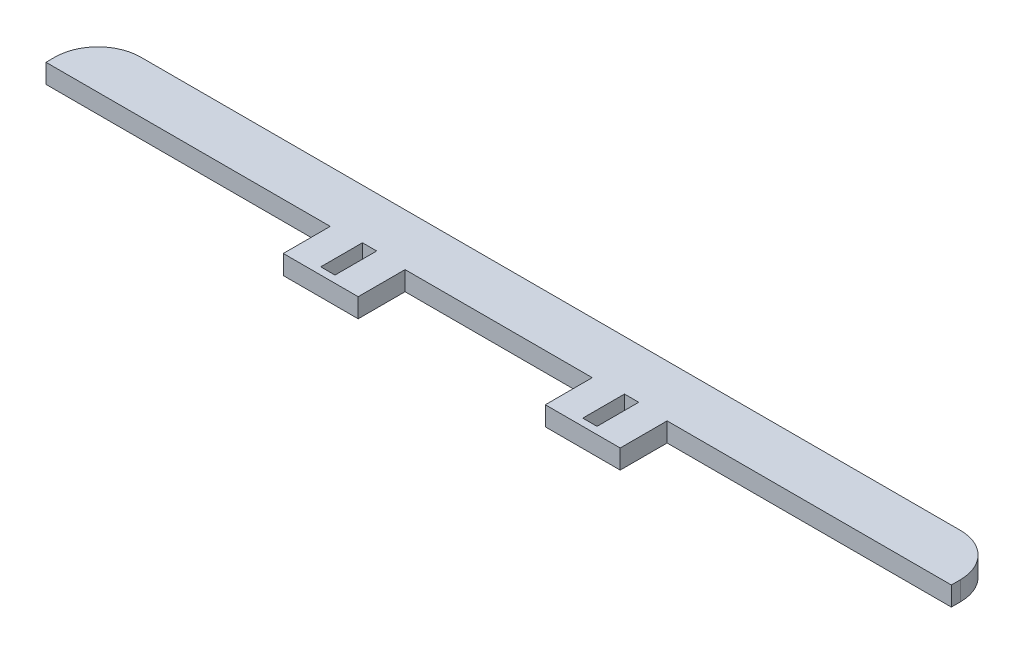
ISO-10303-21;
HEADER;
FILE_DESCRIPTION(('STEP AP214'),'2;1');
FILE_NAME('part.step','',(''),(''),'','','');
FILE_SCHEMA(('AUTOMOTIVE_DESIGN { 1 0 10303 214 1 1 1 1 }'));
ENDSEC;
DATA;
#1=APPLICATION_CONTEXT('core data for automotive mechanical design processes');
#2=APPLICATION_PROTOCOL_DEFINITION('international standard','automotive_design',2000,#1);
#3=PRODUCT_CONTEXT('',#1,'mechanical');
#4=PRODUCT('Part','Part','',(#3));
#5=PRODUCT_RELATED_PRODUCT_CATEGORY('part','',(#4));
#6=PRODUCT_DEFINITION_FORMATION('','',#4);
#7=PRODUCT_DEFINITION_CONTEXT('part definition',#1,'design');
#8=PRODUCT_DEFINITION('design','',#6,#7);
#9=PRODUCT_DEFINITION_SHAPE('','',#8);
#10=(LENGTH_UNIT() NAMED_UNIT(*) SI_UNIT(.MILLI.,.METRE.));
#11=(NAMED_UNIT(*) PLANE_ANGLE_UNIT() SI_UNIT($,.RADIAN.));
#12=(NAMED_UNIT(*) SI_UNIT($,.STERADIAN.) SOLID_ANGLE_UNIT());
#13=UNCERTAINTY_MEASURE_WITH_UNIT(LENGTH_MEASURE(1.E-05),#10,'distance_accuracy_value','');
#14=(GEOMETRIC_REPRESENTATION_CONTEXT(3) GLOBAL_UNCERTAINTY_ASSIGNED_CONTEXT((#13)) GLOBAL_UNIT_ASSIGNED_CONTEXT((#10,
#11,#12)) REPRESENTATION_CONTEXT('',''));
#15=CARTESIAN_POINT('',(0.,0.,0.));
#16=DIRECTION('',(0.,0.,1.));
#17=DIRECTION('',(1.,0.,0.));
#18=AXIS2_PLACEMENT_3D('',#15,#16,#17);
#19=CARTESIAN_POINT('',(11.4999999999774,2.27942664743352E-11,0.));
#20=DIRECTION('',(7.24136028917854E-13,-1.,0.));
#21=DIRECTION('',(0.,0.,1.));
#22=AXIS2_PLACEMENT_3D('',#19,#20,#21);
#23=PLANE('',#22);
#24=DIRECTION('',(-1.,0.,0.));
#25=VECTOR('',#24,1.);
#26=CARTESIAN_POINT('',(44.4999999999735,4.66918170793917E-11,1.));
#27=LINE('',#26,#25);
#28=CARTESIAN_POINT('',(44.4999999999735,4.66918170793917E-11,1.));
#29=VERTEX_POINT('',#28);
#30=CARTESIAN_POINT('',(40.4999999999774,4.66918170793917E-11,1.));
#31=VERTEX_POINT('',#30);
#32=EDGE_CURVE('E205',#29,#31,#27,.T.);
#33=ORIENTED_EDGE('',*,*,#32,.F.);
#34=DIRECTION('',(0.,0.,1.));
#35=VECTOR('',#34,1.);
#36=CARTESIAN_POINT('',(44.4999999999774,4.66918170793917E-11,-10.7));
#37=LINE('',#36,#35);
#38=CARTESIAN_POINT('',(44.4999999999774,4.66918170793917E-11,-10.7));
#39=VERTEX_POINT('',#38);
#40=EDGE_CURVE('E187',#39,#29,#37,.T.);
#41=ORIENTED_EDGE('',*,*,#40,.F.);
#42=DIRECTION('',(1.,7.24136028917854E-13,0.));
#43=VECTOR('',#42,1.);
#44=CARTESIAN_POINT('',(40.4999999999774,4.37913594275585E-11,-10.7));
#45=LINE('',#44,#43);
#46=CARTESIAN_POINT('',(40.4999999999774,4.37913594275585E-11,-10.7));
#47=VERTEX_POINT('',#46);
#48=EDGE_CURVE('E199',#47,#39,#45,.T.);
#49=ORIENTED_EDGE('',*,*,#48,.F.);
#50=DIRECTION('',(0.,0.,-1.));
#51=VECTOR('',#50,1.);
#52=CARTESIAN_POINT('',(40.4999999999774,4.37913594275585E-11,-10.7));
#53=LINE('',#52,#51);
#54=EDGE_CURVE('E211',#31,#47,#53,.T.);
#55=ORIENTED_EDGE('',*,*,#54,.F.);
#56=EDGE_LOOP('',(#33,#41,#49,#55));
#57=FACE_BOUND('',#56,.T.);
#58=DIRECTION('',(0.,0.,1.));
#59=VECTOR('',#58,1.);
#60=CARTESIAN_POINT('',(-33.,0.,-10.7));
#61=LINE('',#60,#59);
#62=CARTESIAN_POINT('',(-33.,0.,-10.7));
#63=VERTEX_POINT('',#62);
#64=CARTESIAN_POINT('',(-33.,0.,1.));
#65=VERTEX_POINT('',#64);
#66=EDGE_CURVE('E270',#63,#65,#61,.T.);
#67=ORIENTED_EDGE('',*,*,#66,.T.);
#68=DIRECTION('',(-1.,0.,0.));
#69=VECTOR('',#68,1.);
#70=CARTESIAN_POINT('',(-33.,0.,1.));
#71=LINE('',#70,#69);
#72=CARTESIAN_POINT('',(-29.,0.,1.));
#73=VERTEX_POINT('',#72);
#74=EDGE_CURVE('E228',#73,#65,#71,.T.);
#75=ORIENTED_EDGE('',*,*,#74,.F.);
#76=DIRECTION('',(0.,0.,-1.));
#77=VECTOR('',#76,1.);
#78=CARTESIAN_POINT('',(-29.,0.,-10.7));
#79=LINE('',#78,#77);
#80=CARTESIAN_POINT('',(-29.,0.,-10.7));
#81=VERTEX_POINT('',#80);
#82=EDGE_CURVE('E263',#73,#81,#79,.T.);
#83=ORIENTED_EDGE('',*,*,#82,.T.);
#84=DIRECTION('',(-1.,0.,0.));
#85=VECTOR('',#84,1.);
#86=CARTESIAN_POINT('',(-29.,0.,-10.7));
#87=LINE('',#86,#85);
#88=EDGE_CURVE('E266',#81,#63,#87,.T.);
#89=ORIENTED_EDGE('',*,*,#88,.T.);
#90=EDGE_LOOP('',(#67,#75,#83,#89));
#91=FACE_BOUND('',#90,.T.);
#92=DIRECTION('',(0.,0.,1.));
#93=VECTOR('',#92,1.);
#94=CARTESIAN_POINT('',(-121.22,0.,-12.7));
#95=LINE('',#94,#93);
#96=CARTESIAN_POINT('',(-121.22,0.,-12.7));
#97=VERTEX_POINT('',#96);
#98=CARTESIAN_POINT('',(-121.22,0.,-10.16));
#99=VERTEX_POINT('',#98);
#100=EDGE_CURVE('E255',#97,#99,#95,.T.);
#101=ORIENTED_EDGE('',*,*,#100,.F.);
#102=CARTESIAN_POINT('',(-109.22,-6.46234349366117E-11,-12.7));
#103=DIRECTION('',(7.24136028917854E-13,-1.,0.));
#104=DIRECTION('',(1.,7.24136028917854E-13,0.));
#105=AXIS2_PLACEMENT_3D('',#102,#103,#104);
#106=CIRCLE('',#105,12.);
#107=CARTESIAN_POINT('',(-109.22,1.10571274358762E-10,-24.7));
#108=VERTEX_POINT('',#107);
#109=EDGE_CURVE('E45',#97,#108,#106,.T.);
#110=ORIENTED_EDGE('',*,*,#109,.T.);
#111=DIRECTION('',(-1.,0.,0.));
#112=VECTOR('',#111,1.);
#113=CARTESIAN_POINT('',(132.719999999977,1.10571274358762E-10,-24.7));
#114=LINE('',#113,#112);
#115=CARTESIAN_POINT('',(120.719999999977,1.10571274358762E-10,-24.7));
#116=VERTEX_POINT('',#115);
#117=EDGE_CURVE('E357',#116,#108,#114,.T.);
#118=ORIENTED_EDGE('',*,*,#117,.F.);
#119=CARTESIAN_POINT('',(120.719999999977,1.01884403552743E-10,-12.7));
#120=DIRECTION('',(7.24136028917854E-13,-1.,0.));
#121=DIRECTION('',(1.,7.24136028917854E-13,0.));
#122=AXIS2_PLACEMENT_3D('',#119,#120,#121);
#123=CIRCLE('',#122,12.);
#124=CARTESIAN_POINT('',(132.719999999977,1.10571274358762E-10,-12.7));
#125=VERTEX_POINT('',#124);
#126=EDGE_CURVE('E52',#116,#125,#123,.T.);
#127=ORIENTED_EDGE('',*,*,#126,.T.);
#128=DIRECTION('',(0.,0.,-1.));
#129=VECTOR('',#128,1.);
#130=CARTESIAN_POINT('',(132.719999999977,1.10571274358762E-10,-12.7));
#131=LINE('',#130,#129);
#132=CARTESIAN_POINT('',(132.719999999977,1.10571274358762E-10,-10.16));
#133=VERTEX_POINT('',#132);
#134=EDGE_CURVE('E306',#133,#125,#131,.T.);
#135=ORIENTED_EDGE('',*,*,#134,.F.);
#136=DIRECTION('',(1.,7.24136028917854E-13,0.));
#137=VECTOR('',#136,1.);
#138=CARTESIAN_POINT('',(73.4999999999774,6.7688910032615E-11,-10.16));
#139=LINE('',#138,#137);
#140=CARTESIAN_POINT('',(52.9999999999774,5.28466159721575E-11,-10.16));
#141=VERTEX_POINT('',#140);
#142=EDGE_CURVE('E329',#141,#133,#139,.T.);
#143=ORIENTED_EDGE('',*,*,#142,.F.);
#144=DIRECTION('',(0.,0.,1.));
#145=VECTOR('',#144,1.);
#146=CARTESIAN_POINT('',(52.9999999999774,5.28466159721575E-11,-10.16));
#147=LINE('',#146,#145);
#148=CARTESIAN_POINT('',(52.9999999999774,5.28466159721575E-11,3.));
#149=VERTEX_POINT('',#148);
#150=EDGE_CURVE('E332',#141,#149,#147,.T.);
#151=ORIENTED_EDGE('',*,*,#150,.T.);
#152=DIRECTION('',(1.,0.,0.));
#153=VECTOR('',#152,1.);
#154=CARTESIAN_POINT('',(31.9999999999735,5.28466159721575E-11,3.));
#155=LINE('',#154,#153);
#156=CARTESIAN_POINT('',(31.9999999999735,5.28466159721575E-11,3.));
#157=VERTEX_POINT('',#156);
#158=EDGE_CURVE('E234',#157,#149,#155,.T.);
#159=ORIENTED_EDGE('',*,*,#158,.F.);
#160=DIRECTION('',(0.,0.,1.));
#161=VECTOR('',#160,1.);
#162=CARTESIAN_POINT('',(31.9999999999774,3.76365605347928E-11,-10.16));
#163=LINE('',#162,#161);
#164=CARTESIAN_POINT('',(31.9999999999774,3.76365605347928E-11,-10.16));
#165=VERTEX_POINT('',#164);
#166=EDGE_CURVE('E326',#165,#157,#163,.T.);
#167=ORIENTED_EDGE('',*,*,#166,.F.);
#168=DIRECTION('',(1.,7.24136028917854E-13,0.));
#169=VECTOR('',#168,1.);
#170=CARTESIAN_POINT('',(31.9999999999774,3.76365605347928E-11,-10.16));
#171=LINE('',#170,#169);
#172=CARTESIAN_POINT('',(-20.5,0.,-10.16));
#173=VERTEX_POINT('',#172);
#174=EDGE_CURVE('E339',#173,#165,#171,.T.);
#175=ORIENTED_EDGE('',*,*,#174,.F.);
#176=DIRECTION('',(0.,0.,1.));
#177=VECTOR('',#176,1.);
#178=CARTESIAN_POINT('',(-20.5,0.,-10.16));
#179=LINE('',#178,#177);
#180=CARTESIAN_POINT('',(-20.5,0.,3.));
#181=VERTEX_POINT('',#180);
#182=EDGE_CURVE('E299',#173,#181,#179,.T.);
#183=ORIENTED_EDGE('',*,*,#182,.T.);
#184=DIRECTION('',(1.,0.,0.));
#185=VECTOR('',#184,1.);
#186=CARTESIAN_POINT('',(-41.5,0.,3.));
#187=LINE('',#186,#185);
#188=CARTESIAN_POINT('',(-41.5,0.,3.));
#189=VERTEX_POINT('',#188);
#190=EDGE_CURVE('E246',#189,#181,#187,.T.);
#191=ORIENTED_EDGE('',*,*,#190,.F.);
#192=DIRECTION('',(0.,0.,1.));
#193=VECTOR('',#192,1.);
#194=CARTESIAN_POINT('',(-41.5,0.,-10.16));
#195=LINE('',#194,#193);
#196=CARTESIAN_POINT('',(-41.5,0.,-10.16));
#197=VERTEX_POINT('',#196);
#198=EDGE_CURVE('E292',#197,#189,#195,.T.);
#199=ORIENTED_EDGE('',*,*,#198,.F.);
#200=DIRECTION('',(1.,0.,0.));
#201=VECTOR('',#200,1.);
#202=CARTESIAN_POINT('',(-62.,0.,-10.16));
#203=LINE('',#202,#201);
#204=EDGE_CURVE('E283',#99,#197,#203,.T.);
#205=ORIENTED_EDGE('',*,*,#204,.F.);
#206=EDGE_LOOP('',(#101,#110,#118,#127,#135,#143,#151,#159,#167,#175,#183,#191,#199,#205));
#207=FACE_BOUND('',#206,.T.);
#208=ADVANCED_FACE('F37',(#57,#91,#207),#23,.T.);
#209=CARTESIAN_POINT('',(11.4999999999735,5.3800000000228,0.));
#210=DIRECTION('',(7.24136028917854E-13,-1.,0.));
#211=DIRECTION('',(0.,0.,1.));
#212=AXIS2_PLACEMENT_3D('',#209,#210,#211);
#213=PLANE('',#212);
#214=DIRECTION('',(0.,0.,1.));
#215=VECTOR('',#214,1.);
#216=CARTESIAN_POINT('',(44.4999999999735,5.38000000004669,-10.7));
#217=LINE('',#216,#215);
#218=CARTESIAN_POINT('',(44.4999999999735,5.38000000004669,-10.7));
#219=VERTEX_POINT('',#218);
#220=CARTESIAN_POINT('',(44.4999999999735,5.38000000004669,1.));
#221=VERTEX_POINT('',#220);
#222=EDGE_CURVE('E313',#219,#221,#217,.T.);
#223=ORIENTED_EDGE('',*,*,#222,.T.);
#224=DIRECTION('',(1.,0.,0.));
#225=VECTOR('',#224,1.);
#226=CARTESIAN_POINT('',(44.4999999999735,5.38000000004669,1.));
#227=LINE('',#226,#225);
#228=CARTESIAN_POINT('',(40.4999999999774,5.38000000004669,1.));
#229=VERTEX_POINT('',#228);
#230=EDGE_CURVE('E207',#229,#221,#227,.T.);
#231=ORIENTED_EDGE('',*,*,#230,.F.);
#232=DIRECTION('',(0.,0.,-1.));
#233=VECTOR('',#232,1.);
#234=CARTESIAN_POINT('',(40.4999999999735,5.38000000004379,-10.7));
#235=LINE('',#234,#233);
#236=CARTESIAN_POINT('',(40.4999999999735,5.38000000004379,-10.7));
#237=VERTEX_POINT('',#236);
#238=EDGE_CURVE('E198',#229,#237,#235,.T.);
#239=ORIENTED_EDGE('',*,*,#238,.T.);
#240=DIRECTION('',(1.,7.24136028917854E-13,0.));
#241=VECTOR('',#240,1.);
#242=CARTESIAN_POINT('',(40.4999999999735,5.38000000004379,-10.7));
#243=LINE('',#242,#241);
#244=EDGE_CURVE('E310',#237,#219,#243,.T.);
#245=ORIENTED_EDGE('',*,*,#244,.T.);
#246=EDGE_LOOP('',(#223,#231,#239,#245));
#247=FACE_BOUND('',#246,.T.);
#248=DIRECTION('',(1.,0.,0.));
#249=VECTOR('',#248,1.);
#250=CARTESIAN_POINT('',(132.719999999977,5.38,-24.7));
#251=LINE('',#250,#249);
#252=CARTESIAN_POINT('',(-109.22,5.38,-24.7));
#253=VERTEX_POINT('',#252);
#254=CARTESIAN_POINT('',(120.719999999973,5.38,-24.7));
#255=VERTEX_POINT('',#254);
#256=EDGE_CURVE('E208',#253,#255,#251,.T.);
#257=ORIENTED_EDGE('',*,*,#256,.F.);
#258=CARTESIAN_POINT('',(-109.22,5.37999999993538,-12.7));
#259=DIRECTION('',(7.24136028917854E-13,-1.,0.));
#260=DIRECTION('',(1.,7.24136028917854E-13,0.));
#261=AXIS2_PLACEMENT_3D('',#258,#259,#260);
#262=CIRCLE('',#261,12.);
#263=CARTESIAN_POINT('',(-121.22,5.38,-12.7));
#264=VERTEX_POINT('',#263);
#265=EDGE_CURVE('E352',#253,#264,#262,.F.);
#266=ORIENTED_EDGE('',*,*,#265,.T.);
#267=DIRECTION('',(0.,0.,-1.));
#268=VECTOR('',#267,1.);
#269=CARTESIAN_POINT('',(-121.22,5.38,-12.7));
#270=LINE('',#269,#268);
#271=CARTESIAN_POINT('',(-121.22,5.38,-10.16));
#272=VERTEX_POINT('',#271);
#273=EDGE_CURVE('E260',#272,#264,#270,.T.);
#274=ORIENTED_EDGE('',*,*,#273,.F.);
#275=DIRECTION('',(-1.,0.,0.));
#276=VECTOR('',#275,1.);
#277=CARTESIAN_POINT('',(-62.,5.38,-10.16));
#278=LINE('',#277,#276);
#279=CARTESIAN_POINT('',(-41.5,5.38,-10.16));
#280=VERTEX_POINT('',#279);
#281=EDGE_CURVE('E290',#280,#272,#278,.T.);
#282=ORIENTED_EDGE('',*,*,#281,.F.);
#283=DIRECTION('',(0.,0.,1.));
#284=VECTOR('',#283,1.);
#285=CARTESIAN_POINT('',(-41.5,5.38,-10.16));
#286=LINE('',#285,#284);
#287=CARTESIAN_POINT('',(-41.5,5.38,3.));
#288=VERTEX_POINT('',#287);
#289=EDGE_CURVE('E293',#280,#288,#286,.T.);
#290=ORIENTED_EDGE('',*,*,#289,.T.);
#291=DIRECTION('',(-1.,0.,0.));
#292=VECTOR('',#291,1.);
#293=CARTESIAN_POINT('',(-41.5,5.38,3.));
#294=LINE('',#293,#292);
#295=CARTESIAN_POINT('',(-20.5,5.38,3.));
#296=VERTEX_POINT('',#295);
#297=EDGE_CURVE('E252',#296,#288,#294,.T.);
#298=ORIENTED_EDGE('',*,*,#297,.F.);
#299=DIRECTION('',(0.,0.,1.));
#300=VECTOR('',#299,1.);
#301=CARTESIAN_POINT('',(-20.5,5.38,-10.16));
#302=LINE('',#301,#300);
#303=CARTESIAN_POINT('',(-20.5,5.38,-10.16));
#304=VERTEX_POINT('',#303);
#305=EDGE_CURVE('E287',#304,#296,#302,.T.);
#306=ORIENTED_EDGE('',*,*,#305,.F.);
#307=DIRECTION('',(-1.,-7.24136028917854E-13,0.));
#308=VECTOR('',#307,1.);
#309=CARTESIAN_POINT('',(31.9999999999735,5.38000000003764,-10.16));
#310=LINE('',#309,#308);
#311=CARTESIAN_POINT('',(31.9999999999735,5.38000000003764,-10.16));
#312=VERTEX_POINT('',#311);
#313=EDGE_CURVE('E337',#312,#304,#310,.T.);
#314=ORIENTED_EDGE('',*,*,#313,.F.);
#315=DIRECTION('',(0.,0.,1.));
#316=VECTOR('',#315,1.);
#317=CARTESIAN_POINT('',(31.9999999999735,5.38000000003764,-10.16));
#318=LINE('',#317,#316);
#319=CARTESIAN_POINT('',(31.9999999999735,5.38000000003764,3.));
#320=VERTEX_POINT('',#319);
#321=EDGE_CURVE('E342',#312,#320,#318,.T.);
#322=ORIENTED_EDGE('',*,*,#321,.T.);
#323=DIRECTION('',(-1.,0.,0.));
#324=VECTOR('',#323,1.);
#325=CARTESIAN_POINT('',(31.9999999999735,5.38000000003764,3.));
#326=LINE('',#325,#324);
#327=CARTESIAN_POINT('',(52.9999999999774,5.38000000003764,3.));
#328=VERTEX_POINT('',#327);
#329=EDGE_CURVE('E240',#328,#320,#326,.T.);
#330=ORIENTED_EDGE('',*,*,#329,.F.);
#331=DIRECTION('',(0.,0.,1.));
#332=VECTOR('',#331,1.);
#333=CARTESIAN_POINT('',(52.9999999999735,5.38000000005285,-10.16));
#334=LINE('',#333,#332);
#335=CARTESIAN_POINT('',(52.9999999999735,5.38000000005285,-10.16));
#336=VERTEX_POINT('',#335);
#337=EDGE_CURVE('E331',#336,#328,#334,.T.);
#338=ORIENTED_EDGE('',*,*,#337,.F.);
#339=DIRECTION('',(-1.,-7.24136028917854E-13,0.));
#340=VECTOR('',#339,1.);
#341=CARTESIAN_POINT('',(73.4999999999735,5.38000000006769,-10.16));
#342=LINE('',#341,#340);
#343=CARTESIAN_POINT('',(132.719999999973,5.38000000011057,-10.16));
#344=VERTEX_POINT('',#343);
#345=EDGE_CURVE('E322',#344,#336,#342,.T.);
#346=ORIENTED_EDGE('',*,*,#345,.F.);
#347=DIRECTION('',(0.,0.,1.));
#348=VECTOR('',#347,1.);
#349=CARTESIAN_POINT('',(132.719999999973,5.38000000011057,-12.7));
#350=LINE('',#349,#348);
#351=CARTESIAN_POINT('',(132.719999999973,5.38000000011057,-12.7));
#352=VERTEX_POINT('',#351);
#353=EDGE_CURVE('E295',#352,#344,#350,.T.);
#354=ORIENTED_EDGE('',*,*,#353,.F.);
#355=CARTESIAN_POINT('',(120.719999999973,5.38000000010189,-12.7));
#356=DIRECTION('',(7.24136028917854E-13,-1.,0.));
#357=DIRECTION('',(1.,7.24136028917854E-13,0.));
#358=AXIS2_PLACEMENT_3D('',#355,#356,#357);
#359=CIRCLE('',#358,12.);
#360=EDGE_CURVE('E350',#352,#255,#359,.F.);
#361=ORIENTED_EDGE('',*,*,#360,.T.);
#362=EDGE_LOOP('',(#257,#266,#274,#282,#290,#298,#306,#314,#322,#330,#338,#346,#354,#361));
#363=FACE_BOUND('',#362,.T.);
#364=DIRECTION('',(1.,0.,0.));
#365=VECTOR('',#364,1.);
#366=CARTESIAN_POINT('',(-33.,5.38,1.));
#367=LINE('',#366,#365);
#368=CARTESIAN_POINT('',(-33.,5.38,1.));
#369=VERTEX_POINT('',#368);
#370=CARTESIAN_POINT('',(-29.,5.38,1.));
#371=VERTEX_POINT('',#370);
#372=EDGE_CURVE('E222',#369,#371,#367,.T.);
#373=ORIENTED_EDGE('',*,*,#372,.F.);
#374=DIRECTION('',(0.,0.,1.));
#375=VECTOR('',#374,1.);
#376=CARTESIAN_POINT('',(-33.,5.38,-10.7));
#377=LINE('',#376,#375);
#378=CARTESIAN_POINT('',(-33.,5.38,-10.7));
#379=VERTEX_POINT('',#378);
#380=EDGE_CURVE('E267',#379,#369,#377,.T.);
#381=ORIENTED_EDGE('',*,*,#380,.F.);
#382=DIRECTION('',(-1.,0.,0.));
#383=VECTOR('',#382,1.);
#384=CARTESIAN_POINT('',(-29.,5.38,-10.7));
#385=LINE('',#384,#383);
#386=CARTESIAN_POINT('',(-29.,5.38,-10.7));
#387=VERTEX_POINT('',#386);
#388=EDGE_CURVE('E274',#387,#379,#385,.T.);
#389=ORIENTED_EDGE('',*,*,#388,.F.);
#390=DIRECTION('',(0.,0.,-1.));
#391=VECTOR('',#390,1.);
#392=CARTESIAN_POINT('',(-29.,5.38,-10.7));
#393=LINE('',#392,#391);
#394=EDGE_CURVE('E262',#371,#387,#393,.T.);
#395=ORIENTED_EDGE('',*,*,#394,.F.);
#396=EDGE_LOOP('',(#373,#381,#389,#395));
#397=FACE_BOUND('',#396,.T.);
#398=ADVANCED_FACE('F370',(#247,#363,#397),#213,.F.);
#399=CARTESIAN_POINT('',(31.9999999999735,5.38000000003764,-10.16));
#400=DIRECTION('',(1.,7.24136028917854E-13,0.));
#401=DIRECTION('',(0.,0.,1.));
#402=AXIS2_PLACEMENT_3D('',#399,#400,#401);
#403=PLANE('',#402);
#404=ORIENTED_EDGE('',*,*,#166,.T.);
#405=DIRECTION('',(0.,-1.,0.));
#406=VECTOR('',#405,1.);
#407=CARTESIAN_POINT('',(31.9999999999735,5.38000000003764,3.));
#408=LINE('',#407,#406);
#409=EDGE_CURVE('E231',#320,#157,#408,.T.);
#410=ORIENTED_EDGE('',*,*,#409,.F.);
#411=ORIENTED_EDGE('',*,*,#321,.F.);
#412=DIRECTION('',(-7.24136028917854E-13,1.,0.));
#413=VECTOR('',#412,1.);
#414=CARTESIAN_POINT('',(31.9999999999735,5.38000000003764,-10.16));
#415=LINE('',#414,#413);
#416=EDGE_CURVE('E319',#165,#312,#415,.T.);
#417=ORIENTED_EDGE('',*,*,#416,.F.);
#418=EDGE_LOOP('',(#404,#410,#411,#417));
#419=FACE_BOUND('',#418,.T.);
#420=ADVANCED_FACE('F399',(#419),#403,.F.);
#421=CARTESIAN_POINT('',(11.4999999999735,5.3800000000228,-10.16));
#422=DIRECTION('',(0.,0.,-1.));
#423=DIRECTION('',(1.,7.24136028917854E-13,0.));
#424=AXIS2_PLACEMENT_3D('',#421,#422,#423);
#425=PLANE('',#424);
#426=ORIENTED_EDGE('',*,*,#416,.T.);
#427=ORIENTED_EDGE('',*,*,#313,.T.);
#428=DIRECTION('',(0.,-1.,0.));
#429=VECTOR('',#428,1.);
#430=CARTESIAN_POINT('',(-20.5,0.,-10.16));
#431=LINE('',#430,#429);
#432=EDGE_CURVE('E280',#304,#173,#431,.T.);
#433=ORIENTED_EDGE('',*,*,#432,.T.);
#434=ORIENTED_EDGE('',*,*,#174,.T.);
#435=EDGE_LOOP('',(#426,#427,#433,#434));
#436=FACE_BOUND('',#435,.T.);
#437=ADVANCED_FACE('F395',(#436),#425,.F.);
#438=CARTESIAN_POINT('',(52.9999999999735,5.38000000005285,-10.16));
#439=DIRECTION('',(-1.,-7.24136028917854E-13,0.));
#440=DIRECTION('',(0.,0.,-1.));
#441=AXIS2_PLACEMENT_3D('',#438,#439,#440);
#442=PLANE('',#441);
#443=ORIENTED_EDGE('',*,*,#337,.T.);
#444=DIRECTION('',(0.,1.,0.));
#445=VECTOR('',#444,1.);
#446=CARTESIAN_POINT('',(52.9999999999774,5.38000000003764,3.));
#447=LINE('',#446,#445);
#448=EDGE_CURVE('E237',#149,#328,#447,.T.);
#449=ORIENTED_EDGE('',*,*,#448,.F.);
#450=ORIENTED_EDGE('',*,*,#150,.F.);
#451=DIRECTION('',(7.24136028917854E-13,-1.,0.));
#452=VECTOR('',#451,1.);
#453=CARTESIAN_POINT('',(52.9999999999735,5.38000000005285,-10.16));
#454=LINE('',#453,#452);
#455=EDGE_CURVE('E325',#336,#141,#454,.T.);
#456=ORIENTED_EDGE('',*,*,#455,.F.);
#457=EDGE_LOOP('',(#443,#449,#450,#456));
#458=FACE_BOUND('',#457,.T.);
#459=ADVANCED_FACE('F409',(#458),#442,.F.);
#460=CARTESIAN_POINT('',(11.4999999999735,5.3800000000228,-10.16));
#461=DIRECTION('',(0.,0.,-1.));
#462=DIRECTION('',(1.,7.24136028917854E-13,0.));
#463=AXIS2_PLACEMENT_3D('',#460,#461,#462);
#464=PLANE('',#463);
#465=ORIENTED_EDGE('',*,*,#142,.T.);
#466=DIRECTION('',(7.24136028917854E-13,-1.,0.));
#467=VECTOR('',#466,1.);
#468=CARTESIAN_POINT('',(132.719999999973,5.38000000011057,-10.16));
#469=LINE('',#468,#467);
#470=EDGE_CURVE('E303',#344,#133,#469,.T.);
#471=ORIENTED_EDGE('',*,*,#470,.F.);
#472=ORIENTED_EDGE('',*,*,#345,.T.);
#473=ORIENTED_EDGE('',*,*,#455,.T.);
#474=EDGE_LOOP('',(#465,#471,#472,#473));
#475=FACE_BOUND('',#474,.T.);
#476=ADVANCED_FACE('F412',(#475),#464,.F.);
#477=CARTESIAN_POINT('',(40.4999999999735,5.38000000004379,-10.7));
#478=DIRECTION('',(-1.,-7.24136028917854E-13,0.));
#479=DIRECTION('',(0.,0.,-1.));
#480=AXIS2_PLACEMENT_3D('',#477,#478,#479);
#481=PLANE('',#480);
#482=ORIENTED_EDGE('',*,*,#54,.T.);
#483=DIRECTION('',(7.24136028917854E-13,-1.,0.));
#484=VECTOR('',#483,1.);
#485=CARTESIAN_POINT('',(40.4999999999735,5.38000000004379,-10.7));
#486=LINE('',#485,#484);
#487=EDGE_CURVE('E315',#237,#47,#486,.T.);
#488=ORIENTED_EDGE('',*,*,#487,.F.);
#489=ORIENTED_EDGE('',*,*,#238,.F.);
#490=DIRECTION('',(0.,1.,0.));
#491=VECTOR('',#490,1.);
#492=CARTESIAN_POINT('',(40.4999999999774,5.38000000004669,1.));
#493=LINE('',#492,#491);
#494=EDGE_CURVE('E213',#31,#229,#493,.T.);
#495=ORIENTED_EDGE('',*,*,#494,.F.);
#496=EDGE_LOOP('',(#482,#488,#489,#495));
#497=FACE_BOUND('',#496,.T.);
#498=ADVANCED_FACE('F438',(#497),#481,.F.);
#499=CARTESIAN_POINT('',(44.4999999999735,5.38000000004669,-10.7));
#500=DIRECTION('',(1.,7.24136028917854E-13,0.));
#501=DIRECTION('',(0.,0.,1.));
#502=AXIS2_PLACEMENT_3D('',#499,#500,#501);
#503=PLANE('',#502);
#504=ORIENTED_EDGE('',*,*,#40,.T.);
#505=DIRECTION('',(0.,-1.,0.));
#506=VECTOR('',#505,1.);
#507=CARTESIAN_POINT('',(44.4999999999735,5.38000000004669,1.));
#508=LINE('',#507,#506);
#509=EDGE_CURVE('E190',#221,#29,#508,.T.);
#510=ORIENTED_EDGE('',*,*,#509,.F.);
#511=ORIENTED_EDGE('',*,*,#222,.F.);
#512=DIRECTION('',(7.24136028917854E-13,-1.,0.));
#513=VECTOR('',#512,1.);
#514=CARTESIAN_POINT('',(44.4999999999735,5.38000000004669,-10.7));
#515=LINE('',#514,#513);
#516=EDGE_CURVE('E193',#219,#39,#515,.T.);
#517=ORIENTED_EDGE('',*,*,#516,.T.);
#518=EDGE_LOOP('',(#504,#510,#511,#517));
#519=FACE_BOUND('',#518,.T.);
#520=ADVANCED_FACE('F189',(#519),#503,.F.);
#521=CARTESIAN_POINT('',(40.4999999999735,5.38000000004379,-10.7));
#522=DIRECTION('',(0.,0.,-1.));
#523=DIRECTION('',(1.,7.24136028917854E-13,0.));
#524=AXIS2_PLACEMENT_3D('',#521,#522,#523);
#525=PLANE('',#524);
#526=ORIENTED_EDGE('',*,*,#48,.T.);
#527=ORIENTED_EDGE('',*,*,#516,.F.);
#528=ORIENTED_EDGE('',*,*,#244,.F.);
#529=ORIENTED_EDGE('',*,*,#487,.T.);
#530=EDGE_LOOP('',(#526,#527,#528,#529));
#531=FACE_BOUND('',#530,.T.);
#532=ADVANCED_FACE('F442',(#531),#525,.F.);
#533=CARTESIAN_POINT('',(132.719999999973,5.38000000011057,0.));
#534=DIRECTION('',(-1.,-7.24136028917854E-13,0.));
#535=DIRECTION('',(0.,0.,-1.));
#536=AXIS2_PLACEMENT_3D('',#533,#534,#535);
#537=PLANE('',#536);
#538=ORIENTED_EDGE('',*,*,#134,.T.);
#539=DIRECTION('',(7.24136028917854E-13,-1.,0.));
#540=VECTOR('',#539,1.);
#541=CARTESIAN_POINT('',(132.719999999973,5.38000000011057,-12.7));
#542=LINE('',#541,#540);
#543=EDGE_CURVE('E11',#125,#352,#542,.F.);
#544=ORIENTED_EDGE('',*,*,#543,.T.);
#545=ORIENTED_EDGE('',*,*,#353,.T.);
#546=ORIENTED_EDGE('',*,*,#470,.T.);
#547=EDGE_LOOP('',(#538,#544,#545,#546));
#548=FACE_BOUND('',#547,.T.);
#549=ADVANCED_FACE('F414',(#548),#537,.F.);
#550=CARTESIAN_POINT('',(-20.5,0.,-10.16));
#551=DIRECTION('',(-1.,0.,0.));
#552=DIRECTION('',(0.,0.,1.));
#553=AXIS2_PLACEMENT_3D('',#550,#551,#552);
#554=PLANE('',#553);
#555=ORIENTED_EDGE('',*,*,#305,.T.);
#556=DIRECTION('',(0.,1.,0.));
#557=VECTOR('',#556,1.);
#558=CARTESIAN_POINT('',(-20.5,5.38,3.));
#559=LINE('',#558,#557);
#560=EDGE_CURVE('E249',#181,#296,#559,.T.);
#561=ORIENTED_EDGE('',*,*,#560,.F.);
#562=ORIENTED_EDGE('',*,*,#182,.F.);
#563=ORIENTED_EDGE('',*,*,#432,.F.);
#564=EDGE_LOOP('',(#555,#561,#562,#563));
#565=FACE_BOUND('',#564,.T.);
#566=ADVANCED_FACE('F389',(#565),#554,.F.);
#567=CARTESIAN_POINT('',(-41.5,0.,-10.16));
#568=DIRECTION('',(1.,0.,0.));
#569=DIRECTION('',(0.,0.,-1.));
#570=AXIS2_PLACEMENT_3D('',#567,#568,#569);
#571=PLANE('',#570);
#572=ORIENTED_EDGE('',*,*,#198,.T.);
#573=DIRECTION('',(0.,-1.,0.));
#574=VECTOR('',#573,1.);
#575=CARTESIAN_POINT('',(-41.5,5.38,3.));
#576=LINE('',#575,#574);
#577=EDGE_CURVE('E243',#288,#189,#576,.T.);
#578=ORIENTED_EDGE('',*,*,#577,.F.);
#579=ORIENTED_EDGE('',*,*,#289,.F.);
#580=DIRECTION('',(0.,1.,0.));
#581=VECTOR('',#580,1.);
#582=CARTESIAN_POINT('',(-41.5,0.,-10.16));
#583=LINE('',#582,#581);
#584=EDGE_CURVE('E286',#197,#280,#583,.T.);
#585=ORIENTED_EDGE('',*,*,#584,.F.);
#586=EDGE_LOOP('',(#572,#578,#579,#585));
#587=FACE_BOUND('',#586,.T.);
#588=ADVANCED_FACE('F385',(#587),#571,.F.);
#589=CARTESIAN_POINT('',(0.,0.,-10.16));
#590=DIRECTION('',(0.,0.,-1.));
#591=DIRECTION('',(-1.,0.,0.));
#592=AXIS2_PLACEMENT_3D('',#589,#590,#591);
#593=PLANE('',#592);
#594=ORIENTED_EDGE('',*,*,#281,.T.);
#595=DIRECTION('',(0.,1.,0.));
#596=VECTOR('',#595,1.);
#597=CARTESIAN_POINT('',(-121.22,0.,-10.16));
#598=LINE('',#597,#596);
#599=EDGE_CURVE('E257',#99,#272,#598,.T.);
#600=ORIENTED_EDGE('',*,*,#599,.F.);
#601=ORIENTED_EDGE('',*,*,#204,.T.);
#602=ORIENTED_EDGE('',*,*,#584,.T.);
#603=EDGE_LOOP('',(#594,#600,#601,#602));
#604=FACE_BOUND('',#603,.T.);
#605=ADVANCED_FACE('F376',(#604),#593,.F.);
#606=CARTESIAN_POINT('',(-29.,0.,-10.7));
#607=DIRECTION('',(1.,0.,0.));
#608=DIRECTION('',(0.,0.,-1.));
#609=AXIS2_PLACEMENT_3D('',#606,#607,#608);
#610=PLANE('',#609);
#611=ORIENTED_EDGE('',*,*,#394,.T.);
#612=DIRECTION('',(0.,1.,0.));
#613=VECTOR('',#612,1.);
#614=CARTESIAN_POINT('',(-29.,0.,-10.7));
#615=LINE('',#614,#613);
#616=EDGE_CURVE('E272',#81,#387,#615,.T.);
#617=ORIENTED_EDGE('',*,*,#616,.F.);
#618=ORIENTED_EDGE('',*,*,#82,.F.);
#619=DIRECTION('',(0.,-1.,0.));
#620=VECTOR('',#619,1.);
#621=CARTESIAN_POINT('',(-29.,5.38,1.));
#622=LINE('',#621,#620);
#623=EDGE_CURVE('E225',#371,#73,#622,.T.);
#624=ORIENTED_EDGE('',*,*,#623,.F.);
#625=EDGE_LOOP('',(#611,#617,#618,#624));
#626=FACE_BOUND('',#625,.T.);
#627=ADVANCED_FACE('F456',(#626),#610,.F.);
#628=CARTESIAN_POINT('',(-33.,0.,-10.7));
#629=DIRECTION('',(-1.,0.,0.));
#630=DIRECTION('',(0.,0.,1.));
#631=AXIS2_PLACEMENT_3D('',#628,#629,#630);
#632=PLANE('',#631);
#633=ORIENTED_EDGE('',*,*,#380,.T.);
#634=DIRECTION('',(0.,1.,0.));
#635=VECTOR('',#634,1.);
#636=CARTESIAN_POINT('',(-33.,5.38,1.));
#637=LINE('',#636,#635);
#638=EDGE_CURVE('E219',#65,#369,#637,.T.);
#639=ORIENTED_EDGE('',*,*,#638,.F.);
#640=ORIENTED_EDGE('',*,*,#66,.F.);
#641=DIRECTION('',(0.,1.,0.));
#642=VECTOR('',#641,1.);
#643=CARTESIAN_POINT('',(-33.,0.,-10.7));
#644=LINE('',#643,#642);
#645=EDGE_CURVE('E278',#63,#379,#644,.T.);
#646=ORIENTED_EDGE('',*,*,#645,.T.);
#647=EDGE_LOOP('',(#633,#639,#640,#646));
#648=FACE_BOUND('',#647,.T.);
#649=ADVANCED_FACE('F459',(#648),#632,.F.);
#650=CARTESIAN_POINT('',(-29.,0.,-10.7));
#651=DIRECTION('',(0.,0.,-1.));
#652=DIRECTION('',(-1.,0.,0.));
#653=AXIS2_PLACEMENT_3D('',#650,#651,#652);
#654=PLANE('',#653);
#655=ORIENTED_EDGE('',*,*,#388,.T.);
#656=ORIENTED_EDGE('',*,*,#645,.F.);
#657=ORIENTED_EDGE('',*,*,#88,.F.);
#658=ORIENTED_EDGE('',*,*,#616,.T.);
#659=EDGE_LOOP('',(#655,#656,#657,#658));
#660=FACE_BOUND('',#659,.T.);
#661=ADVANCED_FACE('F461',(#660),#654,.F.);
#662=CARTESIAN_POINT('',(-121.22,0.,0.));
#663=DIRECTION('',(1.,0.,0.));
#664=DIRECTION('',(0.,0.,-1.));
#665=AXIS2_PLACEMENT_3D('',#662,#663,#664);
#666=PLANE('',#665);
#667=ORIENTED_EDGE('',*,*,#273,.T.);
#668=DIRECTION('',(0.,1.,0.));
#669=VECTOR('',#668,1.);
#670=CARTESIAN_POINT('',(-121.22,0.,-12.7));
#671=LINE('',#670,#669);
#672=EDGE_CURVE('E60',#264,#97,#671,.F.);
#673=ORIENTED_EDGE('',*,*,#672,.T.);
#674=ORIENTED_EDGE('',*,*,#100,.T.);
#675=ORIENTED_EDGE('',*,*,#599,.T.);
#676=EDGE_LOOP('',(#667,#673,#674,#675));
#677=FACE_BOUND('',#676,.T.);
#678=ADVANCED_FACE('F373',(#677),#666,.F.);
#679=CARTESIAN_POINT('',(0.,0.,3.));
#680=DIRECTION('',(0.,0.,1.));
#681=DIRECTION('',(1.,0.,0.));
#682=AXIS2_PLACEMENT_3D('',#679,#680,#681);
#683=PLANE('',#682);
#684=ORIENTED_EDGE('',*,*,#577,.T.);
#685=ORIENTED_EDGE('',*,*,#190,.T.);
#686=ORIENTED_EDGE('',*,*,#560,.T.);
#687=ORIENTED_EDGE('',*,*,#297,.T.);
#688=EDGE_LOOP('',(#684,#685,#686,#687));
#689=FACE_BOUND('',#688,.T.);
#690=ADVANCED_FACE('F383',(#689),#683,.T.);
#691=CARTESIAN_POINT('',(0.,0.,3.));
#692=DIRECTION('',(0.,0.,1.));
#693=DIRECTION('',(1.,0.,0.));
#694=AXIS2_PLACEMENT_3D('',#691,#692,#693);
#695=PLANE('',#694);
#696=ORIENTED_EDGE('',*,*,#409,.T.);
#697=ORIENTED_EDGE('',*,*,#158,.T.);
#698=ORIENTED_EDGE('',*,*,#448,.T.);
#699=ORIENTED_EDGE('',*,*,#329,.T.);
#700=EDGE_LOOP('',(#696,#697,#698,#699));
#701=FACE_BOUND('',#700,.T.);
#702=ADVANCED_FACE('F402',(#701),#695,.T.);
#703=CARTESIAN_POINT('',(0.,0.,1.));
#704=DIRECTION('',(0.,0.,1.));
#705=DIRECTION('',(1.,0.,0.));
#706=AXIS2_PLACEMENT_3D('',#703,#704,#705);
#707=PLANE('',#706);
#708=ORIENTED_EDGE('',*,*,#638,.T.);
#709=ORIENTED_EDGE('',*,*,#372,.T.);
#710=ORIENTED_EDGE('',*,*,#623,.T.);
#711=ORIENTED_EDGE('',*,*,#74,.T.);
#712=EDGE_LOOP('',(#708,#709,#710,#711));
#713=FACE_BOUND('',#712,.T.);
#714=ADVANCED_FACE('F474',(#713),#707,.F.);
#715=CARTESIAN_POINT('',(0.,0.,1.));
#716=DIRECTION('',(0.,0.,-1.));
#717=DIRECTION('',(-1.,0.,0.));
#718=AXIS2_PLACEMENT_3D('',#715,#716,#717);
#719=PLANE('',#718);
#720=ORIENTED_EDGE('',*,*,#509,.T.);
#721=ORIENTED_EDGE('',*,*,#32,.T.);
#722=ORIENTED_EDGE('',*,*,#494,.T.);
#723=ORIENTED_EDGE('',*,*,#230,.T.);
#724=EDGE_LOOP('',(#720,#721,#722,#723));
#725=FACE_BOUND('',#724,.T.);
#726=ADVANCED_FACE('F203',(#725),#719,.T.);
#727=CARTESIAN_POINT('',(0.,0.,-24.7));
#728=DIRECTION('',(0.,0.,1.));
#729=DIRECTION('',(1.,0.,0.));
#730=AXIS2_PLACEMENT_3D('',#727,#728,#729);
#731=PLANE('',#730);
#732=ORIENTED_EDGE('',*,*,#117,.T.);
#733=DIRECTION('',(0.,1.,0.));
#734=VECTOR('',#733,1.);
#735=CARTESIAN_POINT('',(-109.22,0.,-24.7));
#736=LINE('',#735,#734);
#737=EDGE_CURVE('E347',#108,#253,#736,.T.);
#738=ORIENTED_EDGE('',*,*,#737,.T.);
#739=ORIENTED_EDGE('',*,*,#256,.T.);
#740=DIRECTION('',(7.24136028917854E-13,-1.,0.));
#741=VECTOR('',#740,1.);
#742=CARTESIAN_POINT('',(120.719999999977,8.7417701410947E-11,-24.7));
#743=LINE('',#742,#741);
#744=EDGE_CURVE('E334',#255,#116,#743,.T.);
#745=ORIENTED_EDGE('',*,*,#744,.T.);
#746=EDGE_LOOP('',(#732,#738,#739,#745));
#747=FACE_BOUND('',#746,.T.);
#748=ADVANCED_FACE('F362',(#747),#731,.F.);
#749=CARTESIAN_POINT('',(-109.22,0.,-12.7));
#750=DIRECTION('',(0.,1.,0.));
#751=DIRECTION('',(0.,0.,1.));
#752=AXIS2_PLACEMENT_3D('',#749,#750,#751);
#753=CYLINDRICAL_SURFACE('',#752,12.);
#754=ORIENTED_EDGE('',*,*,#109,.F.);
#755=ORIENTED_EDGE('',*,*,#672,.F.);
#756=ORIENTED_EDGE('',*,*,#265,.F.);
#757=ORIENTED_EDGE('',*,*,#737,.F.);
#758=EDGE_LOOP('',(#754,#755,#756,#757));
#759=FACE_BOUND('',#758,.T.);
#760=ADVANCED_FACE('F367',(#759),#753,.T.);
#761=CARTESIAN_POINT('',(120.719999999977,8.7417701410947E-11,-12.7));
#762=DIRECTION('',(7.24136028917854E-13,-1.,0.));
#763=DIRECTION('',(1.,7.24136028917854E-13,0.));
#764=AXIS2_PLACEMENT_3D('',#761,#762,#763);
#765=CYLINDRICAL_SURFACE('',#764,12.);
#766=ORIENTED_EDGE('',*,*,#360,.F.);
#767=ORIENTED_EDGE('',*,*,#543,.F.);
#768=ORIENTED_EDGE('',*,*,#126,.F.);
#769=ORIENTED_EDGE('',*,*,#744,.F.);
#770=EDGE_LOOP('',(#766,#767,#768,#769));
#771=FACE_BOUND('',#770,.T.);
#772=ADVANCED_FACE('F39',(#771),#765,.T.);
#773=CLOSED_SHELL('',(#208,#398,#420,#437,#459,#476,#498,#520,#532,#549,#566,#588,#605,#627,
#649,#661,#678,#690,#702,#714,#726,#748,#760,#772));
#774=MANIFOLD_SOLID_BREP('B2',#773);
#775=ADVANCED_BREP_SHAPE_REPRESENTATION('',(#18,#774),#14);
#776=SHAPE_DEFINITION_REPRESENTATION(#9,#775);
ENDSEC;
END-ISO-10303-21;
